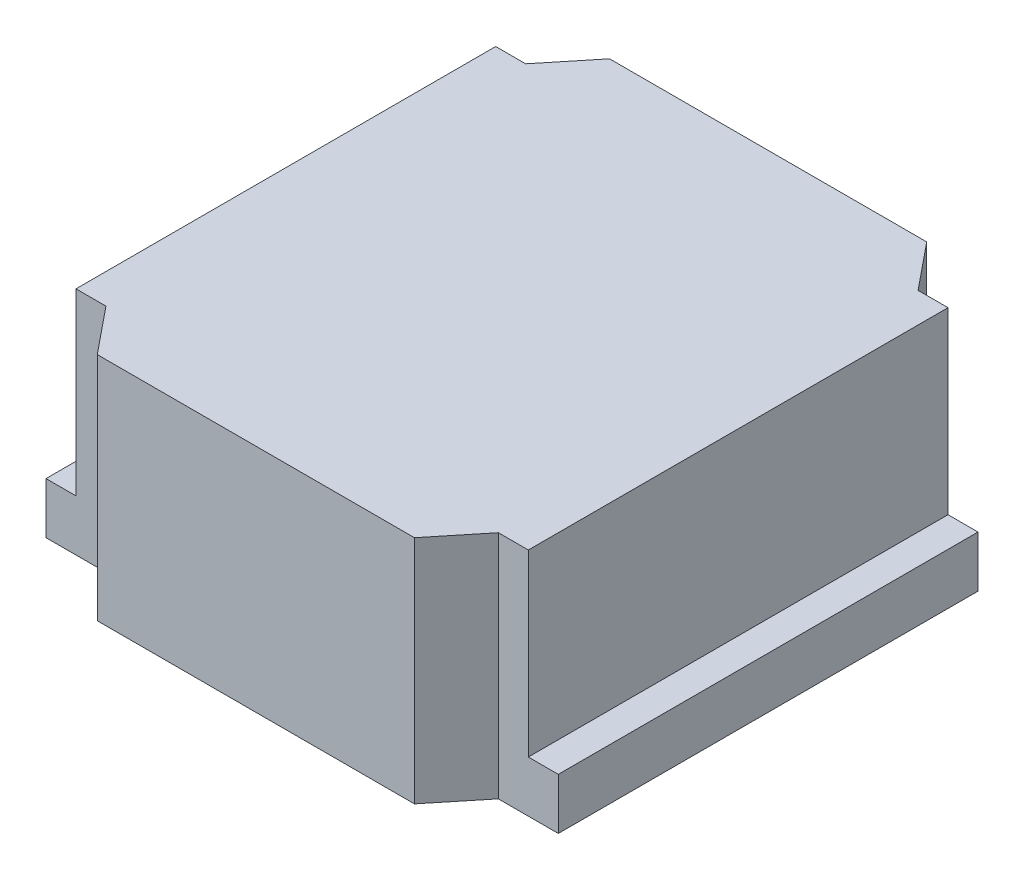
ISO-10303-21;
HEADER;
FILE_DESCRIPTION(('STEP AP214'),'2;1');
FILE_NAME('part.step','',(''),(''),'','','');
FILE_SCHEMA(('AUTOMOTIVE_DESIGN { 1 0 10303 214 1 1 1 1 }'));
ENDSEC;
DATA;
#1=APPLICATION_CONTEXT('core data for automotive mechanical design processes');
#2=APPLICATION_PROTOCOL_DEFINITION('international standard','automotive_design',2000,#1);
#3=PRODUCT_CONTEXT('',#1,'mechanical');
#4=PRODUCT('Part','Part','',(#3));
#5=PRODUCT_RELATED_PRODUCT_CATEGORY('part','',(#4));
#6=PRODUCT_DEFINITION_FORMATION('','',#4);
#7=PRODUCT_DEFINITION_CONTEXT('part definition',#1,'design');
#8=PRODUCT_DEFINITION('design','',#6,#7);
#9=PRODUCT_DEFINITION_SHAPE('','',#8);
#10=(LENGTH_UNIT() NAMED_UNIT(*) SI_UNIT(.MILLI.,.METRE.));
#11=(NAMED_UNIT(*) PLANE_ANGLE_UNIT() SI_UNIT($,.RADIAN.));
#12=(NAMED_UNIT(*) SI_UNIT($,.STERADIAN.) SOLID_ANGLE_UNIT());
#13=UNCERTAINTY_MEASURE_WITH_UNIT(LENGTH_MEASURE(1.E-05),#10,'distance_accuracy_value','');
#14=(GEOMETRIC_REPRESENTATION_CONTEXT(3) GLOBAL_UNCERTAINTY_ASSIGNED_CONTEXT((#13)) GLOBAL_UNIT_ASSIGNED_CONTEXT((#10,
#11,#12)) REPRESENTATION_CONTEXT('',''));
#15=CARTESIAN_POINT('',(0.,0.,0.));
#16=DIRECTION('',(0.,0.,1.));
#17=DIRECTION('',(1.,0.,0.));
#18=AXIS2_PLACEMENT_3D('',#15,#16,#17);
#19=CARTESIAN_POINT('',(6.23198911933,0.85,-16.43854621674));
#20=DIRECTION('',(0.,0.,1.));
#21=DIRECTION('',(1.,0.,0.));
#22=AXIS2_PLACEMENT_3D('',#19,#20,#21);
#23=PLANE('',#22);
#24=DIRECTION('',(1.,0.,0.));
#25=VECTOR('',#24,1.);
#26=CARTESIAN_POINT('',(6.465994559665,0.85,-16.43854621674));
#27=LINE('',#26,#25);
#28=CARTESIAN_POINT('',(6.23198911933,0.85,-16.4385462167397));
#29=VERTEX_POINT('',#28);
#30=CARTESIAN_POINT('',(6.7,0.85,-16.4385462167397));
#31=VERTEX_POINT('',#30);
#32=EDGE_CURVE('E248',#29,#31,#27,.T.);
#33=ORIENTED_EDGE('',*,*,#32,.F.);
#34=DIRECTION('',(0.,1.,0.));
#35=VECTOR('',#34,1.);
#36=CARTESIAN_POINT('',(6.23198911933,1.75,-16.43854621674));
#37=LINE('',#36,#35);
#38=CARTESIAN_POINT('',(6.23198911932959,2.65,-16.43854621674));
#39=VERTEX_POINT('',#38);
#40=EDGE_CURVE('E159',#29,#39,#37,.T.);
#41=ORIENTED_EDGE('',*,*,#40,.T.);
#42=DIRECTION('',(-1.,0.,0.));
#43=VECTOR('',#42,1.);
#44=CARTESIAN_POINT('',(6.465994559665,2.65,-16.43854621674));
#45=LINE('',#44,#43);
#46=CARTESIAN_POINT('',(6.46599455966502,2.65,-16.4385462167397));
#47=VERTEX_POINT('',#46);
#48=EDGE_CURVE('E251',#47,#39,#45,.T.);
#49=ORIENTED_EDGE('',*,*,#48,.F.);
#50=DIRECTION('',(0.,1.,0.));
#51=VECTOR('',#50,1.);
#52=CARTESIAN_POINT('',(6.465994559665,1.95,-16.43854621674));
#53=LINE('',#52,#51);
#54=CARTESIAN_POINT('',(6.46599455966503,1.25,-16.43854621674));
#55=VERTEX_POINT('',#54);
#56=EDGE_CURVE('E221',#55,#47,#53,.T.);
#57=ORIENTED_EDGE('',*,*,#56,.F.);
#58=DIRECTION('',(-1.,0.,0.));
#59=VECTOR('',#58,1.);
#60=CARTESIAN_POINT('',(6.465994559665,1.25,-16.43854621674));
#61=LINE('',#60,#59);
#62=CARTESIAN_POINT('',(6.7,1.25,-16.43854621674));
#63=VERTEX_POINT('',#62);
#64=EDGE_CURVE('E252',#63,#55,#61,.T.);
#65=ORIENTED_EDGE('',*,*,#64,.F.);
#66=DIRECTION('',(0.,1.,0.));
#67=VECTOR('',#66,1.);
#68=CARTESIAN_POINT('',(6.7,1.75,-16.43854621674));
#69=LINE('',#68,#67);
#70=EDGE_CURVE('E166',#31,#63,#69,.T.);
#71=ORIENTED_EDGE('',*,*,#70,.F.);
#72=EDGE_LOOP('',(#33,#41,#49,#57,#65,#71));
#73=FACE_BOUND('',#72,.T.);
#74=ADVANCED_FACE('F17',(#73),#23,.F.);
#75=CARTESIAN_POINT('',(2.7,0.85,-16.43854621674));
#76=DIRECTION('',(0.,0.,1.));
#77=DIRECTION('',(1.,0.,0.));
#78=AXIS2_PLACEMENT_3D('',#75,#76,#77);
#79=PLANE('',#78);
#80=DIRECTION('',(0.,-1.,0.));
#81=VECTOR('',#80,1.);
#82=CARTESIAN_POINT('',(2.7,1.75,-16.43854621674));
#83=LINE('',#82,#81);
#84=CARTESIAN_POINT('',(2.7,1.25,-16.43854621674));
#85=VERTEX_POINT('',#84);
#86=CARTESIAN_POINT('',(2.7,0.85,-16.4385462167397));
#87=VERTEX_POINT('',#86);
#88=EDGE_CURVE('E241',#85,#87,#83,.T.);
#89=ORIENTED_EDGE('',*,*,#88,.F.);
#90=DIRECTION('',(-1.,0.,0.));
#91=VECTOR('',#90,1.);
#92=CARTESIAN_POINT('',(2.934005440335,1.25,-16.43854621674));
#93=LINE('',#92,#91);
#94=CARTESIAN_POINT('',(2.93400544033503,1.25,-16.43854621674));
#95=VERTEX_POINT('',#94);
#96=EDGE_CURVE('E165',#95,#85,#93,.T.);
#97=ORIENTED_EDGE('',*,*,#96,.F.);
#98=DIRECTION('',(0.,-1.,0.));
#99=VECTOR('',#98,1.);
#100=CARTESIAN_POINT('',(2.934005440335,1.95,-16.43854621674));
#101=LINE('',#100,#99);
#102=CARTESIAN_POINT('',(2.93400544033502,2.65,-16.4385462167397));
#103=VERTEX_POINT('',#102);
#104=EDGE_CURVE('E224',#103,#95,#101,.T.);
#105=ORIENTED_EDGE('',*,*,#104,.F.);
#106=DIRECTION('',(-1.,0.,0.));
#107=VECTOR('',#106,1.);
#108=CARTESIAN_POINT('',(2.934005440335,2.65,-16.43854621674));
#109=LINE('',#108,#107);
#110=CARTESIAN_POINT('',(3.16801088067041,2.65,-16.43854621674));
#111=VERTEX_POINT('',#110);
#112=EDGE_CURVE('E163',#111,#103,#109,.T.);
#113=ORIENTED_EDGE('',*,*,#112,.F.);
#114=DIRECTION('',(0.,-1.,0.));
#115=VECTOR('',#114,1.);
#116=CARTESIAN_POINT('',(3.16801088067,1.75,-16.43854621674));
#117=LINE('',#116,#115);
#118=CARTESIAN_POINT('',(3.16801088067,0.85,-16.4385462167397));
#119=VERTEX_POINT('',#118);
#120=EDGE_CURVE('E146',#111,#119,#117,.T.);
#121=ORIENTED_EDGE('',*,*,#120,.T.);
#122=DIRECTION('',(1.,0.,0.));
#123=VECTOR('',#122,1.);
#124=CARTESIAN_POINT('',(2.934005440335,0.85,-16.43854621674));
#125=LINE('',#124,#123);
#126=EDGE_CURVE('E173',#87,#119,#125,.T.);
#127=ORIENTED_EDGE('',*,*,#126,.F.);
#128=EDGE_LOOP('',(#89,#97,#105,#113,#121,#127));
#129=FACE_BOUND('',#128,.T.);
#130=ADVANCED_FACE('F301',(#129),#79,.F.);
#131=CARTESIAN_POINT('',(3.16801088067,0.85,-13.16145378326));
#132=DIRECTION('',(0.,0.,-1.));
#133=DIRECTION('',(-1.,0.,0.));
#134=AXIS2_PLACEMENT_3D('',#131,#132,#133);
#135=PLANE('',#134);
#136=DIRECTION('',(-1.,0.,0.));
#137=VECTOR('',#136,1.);
#138=CARTESIAN_POINT('',(2.934005440335,0.85,-13.16145378326));
#139=LINE('',#138,#137);
#140=CARTESIAN_POINT('',(3.16801088067,0.85,-13.1614537832603));
#141=VERTEX_POINT('',#140);
#142=CARTESIAN_POINT('',(2.7,0.85,-13.1614537832603));
#143=VERTEX_POINT('',#142);
#144=EDGE_CURVE('E172',#141,#143,#139,.T.);
#145=ORIENTED_EDGE('',*,*,#144,.F.);
#146=DIRECTION('',(0.,1.,0.));
#147=VECTOR('',#146,1.);
#148=CARTESIAN_POINT('',(3.16801088067,1.75,-13.16145378326));
#149=LINE('',#148,#147);
#150=CARTESIAN_POINT('',(3.16801088067041,2.65,-13.16145378326));
#151=VERTEX_POINT('',#150);
#152=EDGE_CURVE('E174',#141,#151,#149,.T.);
#153=ORIENTED_EDGE('',*,*,#152,.T.);
#154=DIRECTION('',(1.,0.,0.));
#155=VECTOR('',#154,1.);
#156=CARTESIAN_POINT('',(2.934005440335,2.65,-13.16145378326));
#157=LINE('',#156,#155);
#158=CARTESIAN_POINT('',(2.93400544033498,2.65,-13.1614537832603));
#159=VERTEX_POINT('',#158);
#160=EDGE_CURVE('E170',#159,#151,#157,.T.);
#161=ORIENTED_EDGE('',*,*,#160,.F.);
#162=DIRECTION('',(0.,1.,0.));
#163=VECTOR('',#162,1.);
#164=CARTESIAN_POINT('',(2.934005440335,1.95,-13.16145378326));
#165=LINE('',#164,#163);
#166=CARTESIAN_POINT('',(2.93400544033499,1.25,-13.16145378326));
#167=VERTEX_POINT('',#166);
#168=EDGE_CURVE('E227',#167,#159,#165,.T.);
#169=ORIENTED_EDGE('',*,*,#168,.F.);
#170=DIRECTION('',(1.,0.,0.));
#171=VECTOR('',#170,1.);
#172=CARTESIAN_POINT('',(4.7,1.25,-13.16145378326));
#173=LINE('',#172,#171);
#174=CARTESIAN_POINT('',(2.7,1.25,-13.16145378326));
#175=VERTEX_POINT('',#174);
#176=EDGE_CURVE('E178',#175,#167,#173,.T.);
#177=ORIENTED_EDGE('',*,*,#176,.F.);
#178=DIRECTION('',(0.,1.,0.));
#179=VECTOR('',#178,1.);
#180=CARTESIAN_POINT('',(2.7,1.75,-13.16145378326));
#181=LINE('',#180,#179);
#182=EDGE_CURVE('E190',#143,#175,#181,.T.);
#183=ORIENTED_EDGE('',*,*,#182,.F.);
#184=EDGE_LOOP('',(#145,#153,#161,#169,#177,#183));
#185=FACE_BOUND('',#184,.T.);
#186=ADVANCED_FACE('F294',(#185),#135,.F.);
#187=CARTESIAN_POINT('',(6.7,0.85,-13.16145378326));
#188=DIRECTION('',(0.,0.,-1.));
#189=DIRECTION('',(-1.,0.,0.));
#190=AXIS2_PLACEMENT_3D('',#187,#188,#189);
#191=PLANE('',#190);
#192=DIRECTION('',(0.,-1.,0.));
#193=VECTOR('',#192,1.);
#194=CARTESIAN_POINT('',(6.7,1.75,-13.16145378326));
#195=LINE('',#194,#193);
#196=CARTESIAN_POINT('',(6.7,1.25,-13.16145378326));
#197=VERTEX_POINT('',#196);
#198=CARTESIAN_POINT('',(6.7,0.85,-13.1614537832603));
#199=VERTEX_POINT('',#198);
#200=EDGE_CURVE('E232',#197,#199,#195,.T.);
#201=ORIENTED_EDGE('',*,*,#200,.F.);
#202=DIRECTION('',(1.,0.,0.));
#203=VECTOR('',#202,1.);
#204=CARTESIAN_POINT('',(6.465994559665,1.25,-13.16145378326));
#205=LINE('',#204,#203);
#206=CARTESIAN_POINT('',(6.46599455966498,1.25,-13.16145378326));
#207=VERTEX_POINT('',#206);
#208=EDGE_CURVE('E189',#207,#197,#205,.T.);
#209=ORIENTED_EDGE('',*,*,#208,.F.);
#210=DIRECTION('',(0.,-1.,0.));
#211=VECTOR('',#210,1.);
#212=CARTESIAN_POINT('',(6.465994559665,1.95,-13.16145378326));
#213=LINE('',#212,#211);
#214=CARTESIAN_POINT('',(6.46599455966498,2.65,-13.1614537832603));
#215=VERTEX_POINT('',#214);
#216=EDGE_CURVE('E218',#215,#207,#213,.T.);
#217=ORIENTED_EDGE('',*,*,#216,.F.);
#218=DIRECTION('',(1.,0.,0.));
#219=VECTOR('',#218,1.);
#220=CARTESIAN_POINT('',(6.465994559665,2.65,-13.16145378326));
#221=LINE('',#220,#219);
#222=CARTESIAN_POINT('',(6.23198911932959,2.65,-13.16145378326));
#223=VERTEX_POINT('',#222);
#224=EDGE_CURVE('E187',#223,#215,#221,.T.);
#225=ORIENTED_EDGE('',*,*,#224,.F.);
#226=DIRECTION('',(0.,-1.,0.));
#227=VECTOR('',#226,1.);
#228=CARTESIAN_POINT('',(6.23198911933,1.75,-13.16145378326));
#229=LINE('',#228,#227);
#230=CARTESIAN_POINT('',(6.23198911933,0.85,-13.1614537832603));
#231=VERTEX_POINT('',#230);
#232=EDGE_CURVE('E191',#223,#231,#229,.T.);
#233=ORIENTED_EDGE('',*,*,#232,.T.);
#234=DIRECTION('',(-1.,0.,0.));
#235=VECTOR('',#234,1.);
#236=CARTESIAN_POINT('',(6.465994559665,0.85,-13.16145378326));
#237=LINE('',#236,#235);
#238=EDGE_CURVE('E230',#199,#231,#237,.T.);
#239=ORIENTED_EDGE('',*,*,#238,.F.);
#240=EDGE_LOOP('',(#201,#209,#217,#225,#233,#239));
#241=FACE_BOUND('',#240,.T.);
#242=ADVANCED_FACE('F278',(#241),#191,.F.);
#243=CARTESIAN_POINT('',(2.934005440335,1.25,-16.43854621674));
#244=DIRECTION('',(-1.,0.,0.));
#245=DIRECTION('',(0.,0.,1.));
#246=AXIS2_PLACEMENT_3D('',#243,#244,#245);
#247=PLANE('',#246);
#248=DIRECTION('',(0.,0.,1.));
#249=VECTOR('',#248,1.);
#250=CARTESIAN_POINT('',(2.934005440335,2.65,-14.8));
#251=LINE('',#250,#249);
#252=EDGE_CURVE('E148',#103,#159,#251,.T.);
#253=ORIENTED_EDGE('',*,*,#252,.F.);
#254=ORIENTED_EDGE('',*,*,#104,.T.);
#255=DIRECTION('',(0.,0.,-1.));
#256=VECTOR('',#255,1.);
#257=CARTESIAN_POINT('',(2.934005440335,1.25,-14.8));
#258=LINE('',#257,#256);
#259=EDGE_CURVE('E212',#167,#95,#258,.T.);
#260=ORIENTED_EDGE('',*,*,#259,.F.);
#261=ORIENTED_EDGE('',*,*,#168,.T.);
#262=EDGE_LOOP('',(#253,#254,#260,#261));
#263=FACE_BOUND('',#262,.T.);
#264=ADVANCED_FACE('F305',(#263),#247,.T.);
#265=CARTESIAN_POINT('',(6.465994559665,1.25,-13.16145378326));
#266=DIRECTION('',(1.,0.,0.));
#267=DIRECTION('',(0.,0.,-1.));
#268=AXIS2_PLACEMENT_3D('',#265,#266,#267);
#269=PLANE('',#268);
#270=DIRECTION('',(0.,0.,-1.));
#271=VECTOR('',#270,1.);
#272=CARTESIAN_POINT('',(6.465994559665,2.65,-14.8));
#273=LINE('',#272,#271);
#274=EDGE_CURVE('E195',#215,#47,#273,.T.);
#275=ORIENTED_EDGE('',*,*,#274,.F.);
#276=ORIENTED_EDGE('',*,*,#216,.T.);
#277=DIRECTION('',(0.,0.,1.));
#278=VECTOR('',#277,1.);
#279=CARTESIAN_POINT('',(6.465994559665,1.25,-14.8));
#280=LINE('',#279,#278);
#281=EDGE_CURVE('E161',#55,#207,#280,.T.);
#282=ORIENTED_EDGE('',*,*,#281,.F.);
#283=ORIENTED_EDGE('',*,*,#56,.T.);
#284=EDGE_LOOP('',(#275,#276,#282,#283));
#285=FACE_BOUND('',#284,.T.);
#286=ADVANCED_FACE('F275',(#285),#269,.T.);
#287=CARTESIAN_POINT('',(5.938248700264,0.85,-16.8));
#288=DIRECTION('',(-0.776051768894798,0.,0.630669209645798));
#289=DIRECTION('',(0.630669209645798,0.,0.776051768894798));
#290=AXIS2_PLACEMENT_3D('',#287,#288,#289);
#291=PLANE('',#290);
#292=DIRECTION('',(0.,-1.,0.));
#293=VECTOR('',#292,1.);
#294=CARTESIAN_POINT('',(5.938248700264,1.75,-16.8));
#295=LINE('',#294,#293);
#296=CARTESIAN_POINT('',(5.938248700264,2.65,-16.8));
#297=VERTEX_POINT('',#296);
#298=CARTESIAN_POINT('',(5.938248700264,0.85,-16.8));
#299=VERTEX_POINT('',#298);
#300=EDGE_CURVE('E140',#297,#299,#295,.T.);
#301=ORIENTED_EDGE('',*,*,#300,.F.);
#302=DIRECTION('',(-0.630669209644746,0.,-0.776051768895652));
#303=VECTOR('',#302,1.);
#304=CARTESIAN_POINT('',(6.23198911933,2.65,-16.438546216739));
#305=LINE('',#304,#303);
#306=EDGE_CURVE('E151',#39,#297,#305,.T.);
#307=ORIENTED_EDGE('',*,*,#306,.F.);
#308=ORIENTED_EDGE('',*,*,#40,.F.);
#309=DIRECTION('',(0.630669209645798,0.,0.776051768894798));
#310=VECTOR('',#309,1.);
#311=CARTESIAN_POINT('',(6.085118909797,0.85,-16.61927310837));
#312=LINE('',#311,#310);
#313=EDGE_CURVE('E169',#299,#29,#312,.T.);
#314=ORIENTED_EDGE('',*,*,#313,.F.);
#315=EDGE_LOOP('',(#301,#307,#308,#314));
#316=FACE_BOUND('',#315,.T.);
#317=ADVANCED_FACE('F260',(#316),#291,.F.);
#318=CARTESIAN_POINT('',(3.16801088067,0.85,-16.43854621674));
#319=DIRECTION('',(0.776051768894797,0.,0.6306692096458));
#320=DIRECTION('',(0.6306692096458,0.,-0.776051768894797));
#321=AXIS2_PLACEMENT_3D('',#318,#319,#320);
#322=PLANE('',#321);
#323=ORIENTED_EDGE('',*,*,#120,.F.);
#324=DIRECTION('',(-0.630669209644746,0.,0.776051768895652));
#325=VECTOR('',#324,1.);
#326=CARTESIAN_POINT('',(3.461751299736,2.65,-16.8));
#327=LINE('',#326,#325);
#328=CARTESIAN_POINT('',(3.461751299736,2.65,-16.8));
#329=VERTEX_POINT('',#328);
#330=EDGE_CURVE('E21',#329,#111,#327,.T.);
#331=ORIENTED_EDGE('',*,*,#330,.F.);
#332=DIRECTION('',(0.,1.,0.));
#333=VECTOR('',#332,1.);
#334=CARTESIAN_POINT('',(3.461751299736,1.75,-16.8));
#335=LINE('',#334,#333);
#336=CARTESIAN_POINT('',(3.461751299736,0.85,-16.8));
#337=VERTEX_POINT('',#336);
#338=EDGE_CURVE('E129',#337,#329,#335,.T.);
#339=ORIENTED_EDGE('',*,*,#338,.F.);
#340=DIRECTION('',(0.6306692096458,0.,-0.776051768894797));
#341=VECTOR('',#340,1.);
#342=CARTESIAN_POINT('',(3.314881090203,0.85,-16.61927310837));
#343=LINE('',#342,#341);
#344=EDGE_CURVE('E168',#119,#337,#343,.T.);
#345=ORIENTED_EDGE('',*,*,#344,.F.);
#346=EDGE_LOOP('',(#323,#331,#339,#345));
#347=FACE_BOUND('',#346,.T.);
#348=ADVANCED_FACE('F144',(#347),#322,.F.);
#349=CARTESIAN_POINT('',(2.7,1.25,-16.43854621674));
#350=DIRECTION('',(0.,1.,0.));
#351=DIRECTION('',(0.,0.,1.));
#352=AXIS2_PLACEMENT_3D('',#349,#350,#351);
#353=PLANE('',#352);
#354=DIRECTION('',(0.,0.,-1.));
#355=VECTOR('',#354,1.);
#356=CARTESIAN_POINT('',(2.7,1.25,-14.8));
#357=LINE('',#356,#355);
#358=EDGE_CURVE('E152',#175,#85,#357,.T.);
#359=ORIENTED_EDGE('',*,*,#358,.F.);
#360=ORIENTED_EDGE('',*,*,#176,.T.);
#361=ORIENTED_EDGE('',*,*,#259,.T.);
#362=ORIENTED_EDGE('',*,*,#96,.T.);
#363=EDGE_LOOP('',(#359,#360,#361,#362));
#364=FACE_BOUND('',#363,.T.);
#365=ADVANCED_FACE('F307',(#364),#353,.T.);
#366=CARTESIAN_POINT('',(3.461751299736,0.85,-12.8));
#367=DIRECTION('',(0.776051768894798,0.,-0.630669209645798));
#368=DIRECTION('',(-0.630669209645798,0.,-0.776051768894798));
#369=AXIS2_PLACEMENT_3D('',#366,#367,#368);
#370=PLANE('',#369);
#371=DIRECTION('',(0.,-1.,0.));
#372=VECTOR('',#371,1.);
#373=CARTESIAN_POINT('',(3.461751299736,1.75,-12.8));
#374=LINE('',#373,#372);
#375=CARTESIAN_POINT('',(3.461751299736,2.65,-12.8));
#376=VERTEX_POINT('',#375);
#377=CARTESIAN_POINT('',(3.461751299736,0.85,-12.8));
#378=VERTEX_POINT('',#377);
#379=EDGE_CURVE('E155',#376,#378,#374,.T.);
#380=ORIENTED_EDGE('',*,*,#379,.F.);
#381=DIRECTION('',(0.630669209644748,0.,0.776051768895651));
#382=VECTOR('',#381,1.);
#383=CARTESIAN_POINT('',(3.16801088067,2.65,-13.161453783261));
#384=LINE('',#383,#382);
#385=EDGE_CURVE('E198',#151,#376,#384,.T.);
#386=ORIENTED_EDGE('',*,*,#385,.F.);
#387=ORIENTED_EDGE('',*,*,#152,.F.);
#388=DIRECTION('',(-0.630669209645798,0.,-0.776051768894798));
#389=VECTOR('',#388,1.);
#390=CARTESIAN_POINT('',(3.314881090203,0.85,-12.98072689163));
#391=LINE('',#390,#389);
#392=EDGE_CURVE('E177',#378,#141,#391,.T.);
#393=ORIENTED_EDGE('',*,*,#392,.F.);
#394=EDGE_LOOP('',(#380,#386,#387,#393));
#395=FACE_BOUND('',#394,.T.);
#396=ADVANCED_FACE('F292',(#395),#370,.F.);
#397=CARTESIAN_POINT('',(6.23198911933,0.85,-13.16145378326));
#398=DIRECTION('',(-0.776051768894799,0.,-0.630669209645796));
#399=DIRECTION('',(-0.630669209645796,0.,0.776051768894799));
#400=AXIS2_PLACEMENT_3D('',#397,#398,#399);
#401=PLANE('',#400);
#402=ORIENTED_EDGE('',*,*,#232,.F.);
#403=DIRECTION('',(0.630669209644748,0.,-0.776051768895651));
#404=VECTOR('',#403,1.);
#405=CARTESIAN_POINT('',(5.938248700264,2.65,-12.8));
#406=LINE('',#405,#404);
#407=CARTESIAN_POINT('',(5.938248700264,2.65,-12.8));
#408=VERTEX_POINT('',#407);
#409=EDGE_CURVE('E196',#408,#223,#406,.T.);
#410=ORIENTED_EDGE('',*,*,#409,.F.);
#411=DIRECTION('',(0.,1.,0.));
#412=VECTOR('',#411,1.);
#413=CARTESIAN_POINT('',(5.938248700264,1.75,-12.8));
#414=LINE('',#413,#412);
#415=CARTESIAN_POINT('',(5.938248700264,0.85,-12.8));
#416=VERTEX_POINT('',#415);
#417=EDGE_CURVE('E183',#416,#408,#414,.T.);
#418=ORIENTED_EDGE('',*,*,#417,.F.);
#419=DIRECTION('',(-0.630669209645796,0.,0.776051768894799));
#420=VECTOR('',#419,1.);
#421=CARTESIAN_POINT('',(6.085118909797,0.85,-12.98072689163));
#422=LINE('',#421,#420);
#423=EDGE_CURVE('E36',#231,#416,#422,.T.);
#424=ORIENTED_EDGE('',*,*,#423,.F.);
#425=EDGE_LOOP('',(#402,#410,#418,#424));
#426=FACE_BOUND('',#425,.T.);
#427=ADVANCED_FACE('F283',(#426),#401,.F.);
#428=CARTESIAN_POINT('',(2.934005440335,2.65,-16.8));
#429=DIRECTION('',(0.,1.,0.));
#430=DIRECTION('',(0.,0.,1.));
#431=AXIS2_PLACEMENT_3D('',#428,#429,#430);
#432=PLANE('',#431);
#433=ORIENTED_EDGE('',*,*,#48,.T.);
#434=ORIENTED_EDGE('',*,*,#306,.T.);
#435=DIRECTION('',(1.,0.,0.));
#436=VECTOR('',#435,1.);
#437=CARTESIAN_POINT('',(4.7,2.65,-16.8));
#438=LINE('',#437,#436);
#439=EDGE_CURVE('E134',#329,#297,#438,.T.);
#440=ORIENTED_EDGE('',*,*,#439,.F.);
#441=ORIENTED_EDGE('',*,*,#330,.T.);
#442=ORIENTED_EDGE('',*,*,#112,.T.);
#443=ORIENTED_EDGE('',*,*,#252,.T.);
#444=ORIENTED_EDGE('',*,*,#160,.T.);
#445=ORIENTED_EDGE('',*,*,#385,.T.);
#446=DIRECTION('',(-1.,0.,0.));
#447=VECTOR('',#446,1.);
#448=CARTESIAN_POINT('',(4.7,2.65,-12.8));
#449=LINE('',#448,#447);
#450=EDGE_CURVE('E179',#408,#376,#449,.T.);
#451=ORIENTED_EDGE('',*,*,#450,.F.);
#452=ORIENTED_EDGE('',*,*,#409,.T.);
#453=ORIENTED_EDGE('',*,*,#224,.T.);
#454=ORIENTED_EDGE('',*,*,#274,.T.);
#455=EDGE_LOOP('',(#433,#434,#440,#441,#442,#443,#444,#445,#451,#452,#453,#454));
#456=FACE_BOUND('',#455,.T.);
#457=ADVANCED_FACE('F149',(#456),#432,.T.);
#458=CARTESIAN_POINT('',(2.7,1.25,-16.43854621674));
#459=DIRECTION('',(0.,1.,0.));
#460=DIRECTION('',(0.,0.,1.));
#461=AXIS2_PLACEMENT_3D('',#458,#459,#460);
#462=PLANE('',#461);
#463=DIRECTION('',(0.,0.,1.));
#464=VECTOR('',#463,1.);
#465=CARTESIAN_POINT('',(6.7,1.25,-14.8));
#466=LINE('',#465,#464);
#467=EDGE_CURVE('E182',#63,#197,#466,.T.);
#468=ORIENTED_EDGE('',*,*,#467,.F.);
#469=ORIENTED_EDGE('',*,*,#64,.T.);
#470=ORIENTED_EDGE('',*,*,#281,.T.);
#471=ORIENTED_EDGE('',*,*,#208,.T.);
#472=EDGE_LOOP('',(#468,#469,#470,#471));
#473=FACE_BOUND('',#472,.T.);
#474=ADVANCED_FACE('F273',(#473),#462,.T.);
#475=CARTESIAN_POINT('',(5.938248700264,0.85,-16.8));
#476=DIRECTION('',(0.,0.,-1.));
#477=DIRECTION('',(-1.,0.,0.));
#478=AXIS2_PLACEMENT_3D('',#475,#476,#477);
#479=PLANE('',#478);
#480=ORIENTED_EDGE('',*,*,#338,.T.);
#481=ORIENTED_EDGE('',*,*,#439,.T.);
#482=ORIENTED_EDGE('',*,*,#300,.T.);
#483=DIRECTION('',(-1.,0.,0.));
#484=VECTOR('',#483,1.);
#485=CARTESIAN_POINT('',(4.7,0.85,-16.8));
#486=LINE('',#485,#484);
#487=EDGE_CURVE('E137',#299,#337,#486,.T.);
#488=ORIENTED_EDGE('',*,*,#487,.T.);
#489=EDGE_LOOP('',(#480,#481,#482,#488));
#490=FACE_BOUND('',#489,.T.);
#491=ADVANCED_FACE('F131',(#490),#479,.T.);
#492=CARTESIAN_POINT('',(2.7,0.85,-16.43854621674));
#493=DIRECTION('',(-1.,0.,0.));
#494=DIRECTION('',(0.,0.,1.));
#495=AXIS2_PLACEMENT_3D('',#492,#493,#494);
#496=PLANE('',#495);
#497=ORIENTED_EDGE('',*,*,#88,.T.);
#498=DIRECTION('',(0.,0.,1.));
#499=VECTOR('',#498,1.);
#500=CARTESIAN_POINT('',(2.7,0.85,-14.8));
#501=LINE('',#500,#499);
#502=EDGE_CURVE('E262',#87,#143,#501,.T.);
#503=ORIENTED_EDGE('',*,*,#502,.T.);
#504=ORIENTED_EDGE('',*,*,#182,.T.);
#505=ORIENTED_EDGE('',*,*,#358,.T.);
#506=EDGE_LOOP('',(#497,#503,#504,#505));
#507=FACE_BOUND('',#506,.T.);
#508=ADVANCED_FACE('F298',(#507),#496,.T.);
#509=CARTESIAN_POINT('',(3.461751299736,0.85,-12.8));
#510=DIRECTION('',(0.,0.,1.));
#511=DIRECTION('',(1.,0.,0.));
#512=AXIS2_PLACEMENT_3D('',#509,#510,#511);
#513=PLANE('',#512);
#514=ORIENTED_EDGE('',*,*,#417,.T.);
#515=ORIENTED_EDGE('',*,*,#450,.T.);
#516=ORIENTED_EDGE('',*,*,#379,.T.);
#517=DIRECTION('',(1.,0.,0.));
#518=VECTOR('',#517,1.);
#519=CARTESIAN_POINT('',(4.7,0.85,-12.8));
#520=LINE('',#519,#518);
#521=EDGE_CURVE('E27',#378,#416,#520,.T.);
#522=ORIENTED_EDGE('',*,*,#521,.T.);
#523=EDGE_LOOP('',(#514,#515,#516,#522));
#524=FACE_BOUND('',#523,.T.);
#525=ADVANCED_FACE('F287',(#524),#513,.T.);
#526=CARTESIAN_POINT('',(6.7,0.85,-13.16145378326));
#527=DIRECTION('',(1.,0.,0.));
#528=DIRECTION('',(0.,0.,-1.));
#529=AXIS2_PLACEMENT_3D('',#526,#527,#528);
#530=PLANE('',#529);
#531=ORIENTED_EDGE('',*,*,#200,.T.);
#532=DIRECTION('',(0.,0.,-1.));
#533=VECTOR('',#532,1.);
#534=CARTESIAN_POINT('',(6.7,0.85,-14.8));
#535=LINE('',#534,#533);
#536=EDGE_CURVE('E11',#199,#31,#535,.T.);
#537=ORIENTED_EDGE('',*,*,#536,.T.);
#538=ORIENTED_EDGE('',*,*,#70,.T.);
#539=ORIENTED_EDGE('',*,*,#467,.T.);
#540=EDGE_LOOP('',(#531,#537,#538,#539));
#541=FACE_BOUND('',#540,.T.);
#542=ADVANCED_FACE('F281',(#541),#530,.T.);
#543=CARTESIAN_POINT('',(2.7,0.85,-16.8));
#544=DIRECTION('',(0.,1.,0.));
#545=DIRECTION('',(0.,0.,1.));
#546=AXIS2_PLACEMENT_3D('',#543,#544,#545);
#547=PLANE('',#546);
#548=ORIENTED_EDGE('',*,*,#536,.F.);
#549=ORIENTED_EDGE('',*,*,#238,.T.);
#550=ORIENTED_EDGE('',*,*,#423,.T.);
#551=ORIENTED_EDGE('',*,*,#521,.F.);
#552=ORIENTED_EDGE('',*,*,#392,.T.);
#553=ORIENTED_EDGE('',*,*,#144,.T.);
#554=ORIENTED_EDGE('',*,*,#502,.F.);
#555=ORIENTED_EDGE('',*,*,#126,.T.);
#556=ORIENTED_EDGE('',*,*,#344,.T.);
#557=ORIENTED_EDGE('',*,*,#487,.F.);
#558=ORIENTED_EDGE('',*,*,#313,.T.);
#559=ORIENTED_EDGE('',*,*,#32,.T.);
#560=EDGE_LOOP('',(#548,#549,#550,#551,#552,#553,#554,#555,#556,#557,#558,#559));
#561=FACE_BOUND('',#560,.T.);
#562=ADVANCED_FACE('F19',(#561),#547,.F.);
#563=CLOSED_SHELL('',(#74,#130,#186,#242,#264,#286,#317,#348,#365,#396,#427,#457,#474,#491,#508,
#525,#542,#562));
#564=MANIFOLD_SOLID_BREP('B1',#563);
#565=ADVANCED_BREP_SHAPE_REPRESENTATION('',(#18,#564),#14);
#566=SHAPE_DEFINITION_REPRESENTATION(#9,#565);
ENDSEC;
END-ISO-10303-21;
